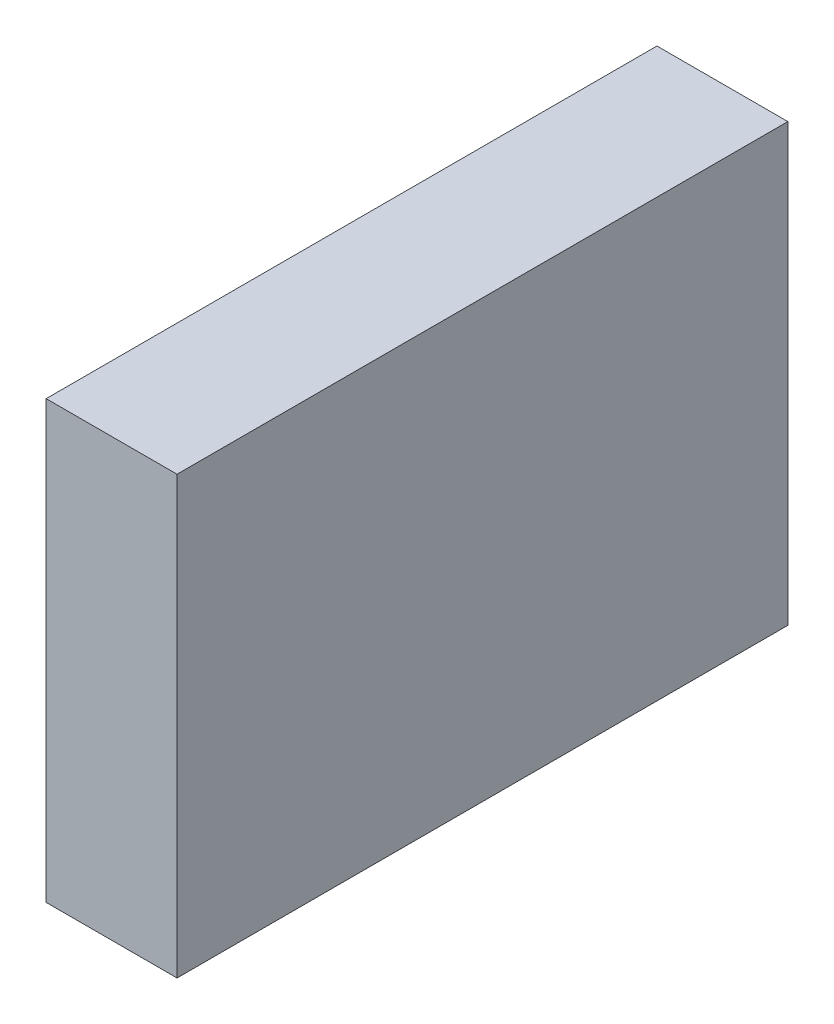
ISO-10303-21;
HEADER;
FILE_DESCRIPTION(('STEP AP214'),'2;1');
FILE_NAME('part.step','',(''),(''),'','','');
FILE_SCHEMA(('AUTOMOTIVE_DESIGN { 1 0 10303 214 1 1 1 1 }'));
ENDSEC;
DATA;
#1=APPLICATION_CONTEXT('core data for automotive mechanical design processes');
#2=APPLICATION_PROTOCOL_DEFINITION('international standard','automotive_design',2000,#1);
#3=PRODUCT_CONTEXT('',#1,'mechanical');
#4=PRODUCT('Part','Part','',(#3));
#5=PRODUCT_RELATED_PRODUCT_CATEGORY('part','',(#4));
#6=PRODUCT_DEFINITION_FORMATION('','',#4);
#7=PRODUCT_DEFINITION_CONTEXT('part definition',#1,'design');
#8=PRODUCT_DEFINITION('design','',#6,#7);
#9=PRODUCT_DEFINITION_SHAPE('','',#8);
#10=(LENGTH_UNIT() NAMED_UNIT(*) SI_UNIT(.MILLI.,.METRE.));
#11=(NAMED_UNIT(*) PLANE_ANGLE_UNIT() SI_UNIT($,.RADIAN.));
#12=(NAMED_UNIT(*) SI_UNIT($,.STERADIAN.) SOLID_ANGLE_UNIT());
#13=UNCERTAINTY_MEASURE_WITH_UNIT(LENGTH_MEASURE(1.E-05),#10,'distance_accuracy_value','');
#14=(GEOMETRIC_REPRESENTATION_CONTEXT(3) GLOBAL_UNCERTAINTY_ASSIGNED_CONTEXT((#13)) GLOBAL_UNIT_ASSIGNED_CONTEXT((#10,
#11,#12)) REPRESENTATION_CONTEXT('',''));
#15=CARTESIAN_POINT('',(0.,0.,0.));
#16=DIRECTION('',(0.,0.,1.));
#17=DIRECTION('',(1.,0.,0.));
#18=AXIS2_PLACEMENT_3D('',#15,#16,#17);
#19=CARTESIAN_POINT('',(-3.9,-1.82000017746824,-3.72112168010555));
#20=DIRECTION('',(1.,0.,0.));
#21=DIRECTION('',(0.,1.,8.74227765734759E-08));
#22=AXIS2_PLACEMENT_3D('',#19,#20,#21);
#23=PLANE('',#22);
#24=DIRECTION('',(0.,-0.999999999999996,-8.74227765733007E-08));
#25=VECTOR('',#24,1.);
#26=CARTESIAN_POINT('',(-3.9,-0.750000305977718,-2.25112158656318));
#27=LINE('',#26,#25);
#28=CARTESIAN_POINT('',(-3.9,-0.750000305978718,-2.25112158656318));
#29=VERTEX_POINT('',#28);
#30=CARTESIAN_POINT('',(-3.9,-1.75000030597972,-2.25112167398695));
#31=VERTEX_POINT('',#30);
#32=EDGE_CURVE('E11',#29,#31,#27,.T.);
#33=ORIENTED_EDGE('',*,*,#32,.T.);
#34=DIRECTION('',(0.,8.74227764783136E-08,-0.999999999999996));
#35=VECTOR('',#34,1.);
#36=CARTESIAN_POINT('',(-3.9,-1.75000030597972,-2.25112167398595));
#37=LINE('',#36,#35);
#38=CARTESIAN_POINT('',(-3.9,-1.75000018358683,-3.65112167398595));
#39=VERTEX_POINT('',#38);
#40=EDGE_CURVE('E69',#31,#39,#37,.T.);
#41=ORIENTED_EDGE('',*,*,#40,.T.);
#42=DIRECTION('',(0.,0.999999999999996,8.74227765733007E-08));
#43=VECTOR('',#42,1.);
#44=CARTESIAN_POINT('',(-3.9,-1.75000018358783,-3.65112167398595));
#45=LINE('',#44,#43);
#46=CARTESIAN_POINT('',(-3.9,-0.750000183585831,-3.65112158656218));
#47=VERTEX_POINT('',#46);
#48=EDGE_CURVE('E55',#39,#47,#45,.T.);
#49=ORIENTED_EDGE('',*,*,#48,.T.);
#50=DIRECTION('',(0.,-8.74227765576152E-08,0.999999999999996));
#51=VECTOR('',#50,1.);
#52=CARTESIAN_POINT('',(-3.9,-0.750000183585831,-3.65112158656318));
#53=LINE('',#52,#51);
#54=EDGE_CURVE('E53',#47,#29,#53,.T.);
#55=ORIENTED_EDGE('',*,*,#54,.T.);
#56=EDGE_LOOP('',(#33,#41,#49,#55));
#57=FACE_BOUND('',#56,.T.);
#58=ADVANCED_FACE('F17',(#57),#23,.T.);
#59=CARTESIAN_POINT('',(-4.2,-1.82000017746824,-3.72112168010555));
#60=DIRECTION('',(1.,0.,0.));
#61=DIRECTION('',(0.,1.,8.74227765734759E-08));
#62=AXIS2_PLACEMENT_3D('',#59,#60,#61);
#63=PLANE('',#62);
#64=DIRECTION('',(0.,-8.74227765576152E-08,0.999999999999996));
#65=VECTOR('',#64,1.);
#66=CARTESIAN_POINT('',(-4.2,-0.750000183585831,-3.65112158656318));
#67=LINE('',#66,#65);
#68=CARTESIAN_POINT('',(-4.2,-0.750000183585831,-3.65112158656218));
#69=VERTEX_POINT('',#68);
#70=CARTESIAN_POINT('',(-4.2,-0.750000305978718,-2.25112158656318));
#71=VERTEX_POINT('',#70);
#72=EDGE_CURVE('E24',#69,#71,#67,.T.);
#73=ORIENTED_EDGE('',*,*,#72,.F.);
#74=DIRECTION('',(0.,0.999999999999996,8.74227765733007E-08));
#75=VECTOR('',#74,1.);
#76=CARTESIAN_POINT('',(-4.2,-1.75000018358783,-3.65112167398595));
#77=LINE('',#76,#75);
#78=CARTESIAN_POINT('',(-4.2,-1.75000018358683,-3.65112167398595));
#79=VERTEX_POINT('',#78);
#80=EDGE_CURVE('E70',#79,#69,#77,.T.);
#81=ORIENTED_EDGE('',*,*,#80,.F.);
#82=DIRECTION('',(0.,8.74227766369168E-08,-0.999999999999996));
#83=VECTOR('',#82,1.);
#84=CARTESIAN_POINT('',(-4.2,-1.75000030597972,-2.25112167398595));
#85=LINE('',#84,#83);
#86=CARTESIAN_POINT('',(-4.2,-1.75000030597972,-2.25112167398695));
#87=VERTEX_POINT('',#86);
#88=EDGE_CURVE('E59',#87,#79,#85,.T.);
#89=ORIENTED_EDGE('',*,*,#88,.F.);
#90=DIRECTION('',(0.,-0.999999999999996,-8.74227765733007E-08));
#91=VECTOR('',#90,1.);
#92=CARTESIAN_POINT('',(-4.2,-0.750000305977718,-2.25112158656318));
#93=LINE('',#92,#91);
#94=EDGE_CURVE('E78',#71,#87,#93,.T.);
#95=ORIENTED_EDGE('',*,*,#94,.F.);
#96=EDGE_LOOP('',(#73,#81,#89,#95));
#97=FACE_BOUND('',#96,.T.);
#98=ADVANCED_FACE('F89',(#97),#63,.F.);
#99=CARTESIAN_POINT('',(-3.9,-0.750000305977718,-2.25112158656318));
#100=DIRECTION('',(0.,8.74227765734759E-08,-1.));
#101=DIRECTION('',(0.,-1.,-8.74227765734759E-08));
#102=AXIS2_PLACEMENT_3D('',#99,#100,#101);
#103=PLANE('',#102);
#104=DIRECTION('',(-1.,0.,0.));
#105=VECTOR('',#104,1.);
#106=CARTESIAN_POINT('',(-3.9,-0.750000305977718,-2.25112158656318));
#107=LINE('',#106,#105);
#108=EDGE_CURVE('E65',#29,#71,#107,.T.);
#109=ORIENTED_EDGE('',*,*,#108,.T.);
#110=ORIENTED_EDGE('',*,*,#94,.T.);
#111=DIRECTION('',(-1.,0.,0.));
#112=VECTOR('',#111,1.);
#113=CARTESIAN_POINT('',(-3.9,-1.75000030597972,-2.25112167398595));
#114=LINE('',#113,#112);
#115=EDGE_CURVE('E66',#31,#87,#114,.T.);
#116=ORIENTED_EDGE('',*,*,#115,.F.);
#117=ORIENTED_EDGE('',*,*,#32,.F.);
#118=EDGE_LOOP('',(#109,#110,#116,#117));
#119=FACE_BOUND('',#118,.T.);
#120=ADVANCED_FACE('F63',(#119),#103,.F.);
#121=CARTESIAN_POINT('',(-3.9,-1.75000030597972,-2.25112167398595));
#122=DIRECTION('',(0.,1.,8.74227765734759E-08));
#123=DIRECTION('',(0.,8.74227765734759E-08,-1.));
#124=AXIS2_PLACEMENT_3D('',#121,#122,#123);
#125=PLANE('',#124);
#126=ORIENTED_EDGE('',*,*,#115,.T.);
#127=ORIENTED_EDGE('',*,*,#88,.T.);
#128=DIRECTION('',(-1.,0.,0.));
#129=VECTOR('',#128,1.);
#130=CARTESIAN_POINT('',(-3.9,-1.75000018358783,-3.65112167398595));
#131=LINE('',#130,#129);
#132=EDGE_CURVE('E60',#39,#79,#131,.T.);
#133=ORIENTED_EDGE('',*,*,#132,.F.);
#134=ORIENTED_EDGE('',*,*,#40,.F.);
#135=EDGE_LOOP('',(#126,#127,#133,#134));
#136=FACE_BOUND('',#135,.T.);
#137=ADVANCED_FACE('F91',(#136),#125,.F.);
#138=CARTESIAN_POINT('',(-3.9,-1.75000018358783,-3.65112167398595));
#139=DIRECTION('',(0.,-8.74227765734759E-08,1.));
#140=DIRECTION('',(0.,1.,8.74227765734759E-08));
#141=AXIS2_PLACEMENT_3D('',#138,#139,#140);
#142=PLANE('',#141);
#143=ORIENTED_EDGE('',*,*,#132,.T.);
#144=ORIENTED_EDGE('',*,*,#80,.T.);
#145=DIRECTION('',(-1.,0.,0.));
#146=VECTOR('',#145,1.);
#147=CARTESIAN_POINT('',(-3.9,-0.750000183585831,-3.65112158656318));
#148=LINE('',#147,#146);
#149=EDGE_CURVE('E84',#47,#69,#148,.T.);
#150=ORIENTED_EDGE('',*,*,#149,.F.);
#151=ORIENTED_EDGE('',*,*,#48,.F.);
#152=EDGE_LOOP('',(#143,#144,#150,#151));
#153=FACE_BOUND('',#152,.T.);
#154=ADVANCED_FACE('F86',(#153),#142,.F.);
#155=CARTESIAN_POINT('',(-3.9,-0.750000183585831,-3.65112158656318));
#156=DIRECTION('',(0.,-1.,-8.74227765734759E-08));
#157=DIRECTION('',(0.,-8.74227765734759E-08,1.));
#158=AXIS2_PLACEMENT_3D('',#155,#156,#157);
#159=PLANE('',#158);
#160=ORIENTED_EDGE('',*,*,#149,.T.);
#161=ORIENTED_EDGE('',*,*,#72,.T.);
#162=ORIENTED_EDGE('',*,*,#108,.F.);
#163=ORIENTED_EDGE('',*,*,#54,.F.);
#164=EDGE_LOOP('',(#160,#161,#162,#163));
#165=FACE_BOUND('',#164,.T.);
#166=ADVANCED_FACE('F68',(#165),#159,.F.);
#167=CLOSED_SHELL('',(#58,#98,#120,#137,#154,#166));
#168=MANIFOLD_SOLID_BREP('B1',#167);
#169=ADVANCED_BREP_SHAPE_REPRESENTATION('',(#18,#168),#14);
#170=SHAPE_DEFINITION_REPRESENTATION(#9,#169);
ENDSEC;
END-ISO-10303-21;
